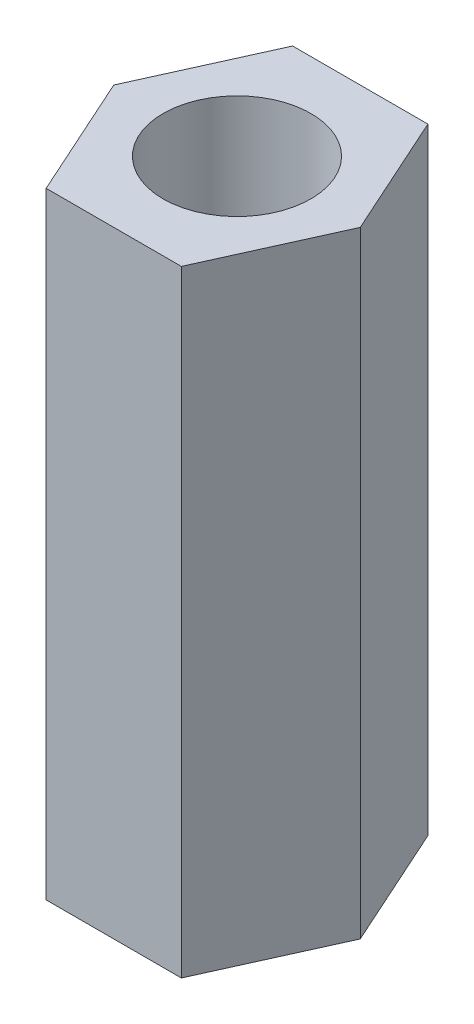
ISO-10303-21;
HEADER;
FILE_DESCRIPTION(('STEP AP214'),'2;1');
FILE_NAME('part.step','',(''),(''),'','','');
FILE_SCHEMA(('AUTOMOTIVE_DESIGN { 1 0 10303 214 1 1 1 1 }'));
ENDSEC;
DATA;
#1=APPLICATION_CONTEXT('core data for automotive mechanical design processes');
#2=APPLICATION_PROTOCOL_DEFINITION('international standard','automotive_design',2000,#1);
#3=PRODUCT_CONTEXT('',#1,'mechanical');
#4=PRODUCT('Part','Part','',(#3));
#5=PRODUCT_RELATED_PRODUCT_CATEGORY('part','',(#4));
#6=PRODUCT_DEFINITION_FORMATION('','',#4);
#7=PRODUCT_DEFINITION_CONTEXT('part definition',#1,'design');
#8=PRODUCT_DEFINITION('design','',#6,#7);
#9=PRODUCT_DEFINITION_SHAPE('','',#8);
#10=(LENGTH_UNIT() NAMED_UNIT(*) SI_UNIT(.MILLI.,.METRE.));
#11=(NAMED_UNIT(*) PLANE_ANGLE_UNIT() SI_UNIT($,.RADIAN.));
#12=(NAMED_UNIT(*) SI_UNIT($,.STERADIAN.) SOLID_ANGLE_UNIT());
#13=UNCERTAINTY_MEASURE_WITH_UNIT(LENGTH_MEASURE(1.E-05),#10,'distance_accuracy_value','');
#14=(GEOMETRIC_REPRESENTATION_CONTEXT(3) GLOBAL_UNCERTAINTY_ASSIGNED_CONTEXT((#13)) GLOBAL_UNIT_ASSIGNED_CONTEXT((#10,
#11,#12)) REPRESENTATION_CONTEXT('',''));
#15=CARTESIAN_POINT('',(0.,0.,0.));
#16=DIRECTION('',(0.,0.,1.));
#17=DIRECTION('',(1.,0.,0.));
#18=AXIS2_PLACEMENT_3D('',#15,#16,#17);
#19=CARTESIAN_POINT('',(-7.25708114822568,25.,-5.));
#20=DIRECTION('',(0.,-1.,0.));
#21=DIRECTION('',(0.,0.,-1.));
#22=AXIS2_PLACEMENT_3D('',#19,#20,#21);
#23=PLANE('',#22);
#24=DIRECTION('',(0.411437827766148,0.,0.911437827766148));
#25=VECTOR('',#24,1.);
#26=CARTESIAN_POINT('',(-2.74291885177432,25.,5.));
#27=LINE('',#26,#25);
#28=CARTESIAN_POINT('',(-5.,25.,0.));
#29=VERTEX_POINT('',#28);
#30=CARTESIAN_POINT('',(-2.74291885177432,25.,5.));
#31=VERTEX_POINT('',#30);
#32=EDGE_CURVE('E129',#29,#31,#27,.T.);
#33=ORIENTED_EDGE('',*,*,#32,.T.);
#34=DIRECTION('',(1.,0.,0.));
#35=VECTOR('',#34,1.);
#36=CARTESIAN_POINT('',(2.74291885177432,25.,5.));
#37=LINE('',#36,#35);
#38=CARTESIAN_POINT('',(2.74291885177432,25.,5.));
#39=VERTEX_POINT('',#38);
#40=EDGE_CURVE('E87',#31,#39,#37,.T.);
#41=ORIENTED_EDGE('',*,*,#40,.T.);
#42=DIRECTION('',(0.411437827766148,0.,-0.911437827766147));
#43=VECTOR('',#42,1.);
#44=CARTESIAN_POINT('',(5.,25.,0.));
#45=LINE('',#44,#43);
#46=CARTESIAN_POINT('',(5.,25.,0.));
#47=VERTEX_POINT('',#46);
#48=EDGE_CURVE('E100',#39,#47,#45,.T.);
#49=ORIENTED_EDGE('',*,*,#48,.T.);
#50=DIRECTION('',(-0.411437827766148,0.,-0.911437827766147));
#51=VECTOR('',#50,1.);
#52=CARTESIAN_POINT('',(2.74291885177432,25.,-5.));
#53=LINE('',#52,#51);
#54=CARTESIAN_POINT('',(2.74291885177432,25.,-5.));
#55=VERTEX_POINT('',#54);
#56=EDGE_CURVE('E94',#47,#55,#53,.T.);
#57=ORIENTED_EDGE('',*,*,#56,.T.);
#58=DIRECTION('',(-1.,0.,0.));
#59=VECTOR('',#58,1.);
#60=CARTESIAN_POINT('',(-2.74291885177432,25.,-5.));
#61=LINE('',#60,#59);
#62=CARTESIAN_POINT('',(-2.74291885177432,25.,-5.));
#63=VERTEX_POINT('',#62);
#64=EDGE_CURVE('E98',#55,#63,#61,.T.);
#65=ORIENTED_EDGE('',*,*,#64,.T.);
#66=DIRECTION('',(-0.411437827766148,0.,0.911437827766148));
#67=VECTOR('',#66,1.);
#68=CARTESIAN_POINT('',(-5.,25.,0.));
#69=LINE('',#68,#67);
#70=EDGE_CURVE('E50',#63,#29,#69,.T.);
#71=ORIENTED_EDGE('',*,*,#70,.T.);
#72=EDGE_LOOP('',(#33,#41,#49,#57,#65,#71));
#73=FACE_BOUND('',#72,.T.);
#74=CARTESIAN_POINT('',(0.,25.,0.));
#75=DIRECTION('',(0.,1.,0.));
#76=DIRECTION('',(0.,0.,1.));
#77=AXIS2_PLACEMENT_3D('',#74,#75,#76);
#78=CIRCLE('',#77,3.);
#79=CARTESIAN_POINT('',(0.,25.,3.));
#80=VERTEX_POINT('',#79);
#81=EDGE_CURVE('E122',#80,#80,#78,.T.);
#82=ORIENTED_EDGE('',*,*,#81,.F.);
#83=EDGE_LOOP('',(#82));
#84=FACE_BOUND('',#83,.T.);
#85=ADVANCED_FACE('F33',(#73,#84),#23,.F.);
#86=CARTESIAN_POINT('',(-7.25708114822568,0.,-5.));
#87=DIRECTION('',(0.,-1.,0.));
#88=DIRECTION('',(0.,0.,-1.));
#89=AXIS2_PLACEMENT_3D('',#86,#87,#88);
#90=PLANE('',#89);
#91=DIRECTION('',(0.411437827766148,0.,0.911437827766148));
#92=VECTOR('',#91,1.);
#93=CARTESIAN_POINT('',(-2.74291885177432,0.,5.));
#94=LINE('',#93,#92);
#95=CARTESIAN_POINT('',(-5.,0.,0.));
#96=VERTEX_POINT('',#95);
#97=CARTESIAN_POINT('',(-2.74291885177432,0.,5.));
#98=VERTEX_POINT('',#97);
#99=EDGE_CURVE('E118',#96,#98,#94,.T.);
#100=ORIENTED_EDGE('',*,*,#99,.F.);
#101=DIRECTION('',(-0.411437827766148,0.,0.911437827766148));
#102=VECTOR('',#101,1.);
#103=CARTESIAN_POINT('',(-5.,0.,0.));
#104=LINE('',#103,#102);
#105=CARTESIAN_POINT('',(-2.74291885177432,0.,-5.));
#106=VERTEX_POINT('',#105);
#107=EDGE_CURVE('E79',#106,#96,#104,.T.);
#108=ORIENTED_EDGE('',*,*,#107,.F.);
#109=DIRECTION('',(-1.,0.,0.));
#110=VECTOR('',#109,1.);
#111=CARTESIAN_POINT('',(-2.74291885177432,0.,-5.));
#112=LINE('',#111,#110);
#113=CARTESIAN_POINT('',(2.74291885177432,0.,-5.));
#114=VERTEX_POINT('',#113);
#115=EDGE_CURVE('E73',#114,#106,#112,.T.);
#116=ORIENTED_EDGE('',*,*,#115,.F.);
#117=DIRECTION('',(-0.411437827766148,0.,-0.911437827766147));
#118=VECTOR('',#117,1.);
#119=CARTESIAN_POINT('',(2.74291885177432,0.,-5.));
#120=LINE('',#119,#118);
#121=CARTESIAN_POINT('',(5.,0.,0.));
#122=VERTEX_POINT('',#121);
#123=EDGE_CURVE('E108',#122,#114,#120,.T.);
#124=ORIENTED_EDGE('',*,*,#123,.F.);
#125=DIRECTION('',(0.411437827766148,0.,-0.911437827766147));
#126=VECTOR('',#125,1.);
#127=CARTESIAN_POINT('',(5.,0.,0.));
#128=LINE('',#127,#126);
#129=CARTESIAN_POINT('',(2.74291885177432,0.,5.));
#130=VERTEX_POINT('',#129);
#131=EDGE_CURVE('E124',#130,#122,#128,.T.);
#132=ORIENTED_EDGE('',*,*,#131,.F.);
#133=DIRECTION('',(1.,0.,0.));
#134=VECTOR('',#133,1.);
#135=CARTESIAN_POINT('',(2.74291885177432,0.,5.));
#136=LINE('',#135,#134);
#137=EDGE_CURVE('E121',#98,#130,#136,.T.);
#138=ORIENTED_EDGE('',*,*,#137,.F.);
#139=EDGE_LOOP('',(#100,#108,#116,#124,#132,#138));
#140=FACE_BOUND('',#139,.T.);
#141=CARTESIAN_POINT('',(0.,0.,0.));
#142=DIRECTION('',(0.,1.,0.));
#143=DIRECTION('',(0.,0.,1.));
#144=AXIS2_PLACEMENT_3D('',#141,#142,#143);
#145=CIRCLE('',#144,3.);
#146=CARTESIAN_POINT('',(0.,0.,3.));
#147=VERTEX_POINT('',#146);
#148=EDGE_CURVE('E222',#147,#147,#145,.T.);
#149=ORIENTED_EDGE('',*,*,#148,.T.);
#150=EDGE_LOOP('',(#149));
#151=FACE_BOUND('',#150,.T.);
#152=ADVANCED_FACE('F138',(#140,#151),#90,.T.);
#153=CARTESIAN_POINT('',(-2.74291885177432,25.,5.));
#154=DIRECTION('',(0.911437827766148,0.,-0.411437827766148));
#155=DIRECTION('',(-0.411437827766148,0.,-0.911437827766148));
#156=AXIS2_PLACEMENT_3D('',#153,#154,#155);
#157=PLANE('',#156);
#158=ORIENTED_EDGE('',*,*,#99,.T.);
#159=DIRECTION('',(0.,-1.,0.));
#160=VECTOR('',#159,1.);
#161=CARTESIAN_POINT('',(-2.74291885177432,25.,5.));
#162=LINE('',#161,#160);
#163=EDGE_CURVE('E11',#31,#98,#162,.T.);
#164=ORIENTED_EDGE('',*,*,#163,.F.);
#165=ORIENTED_EDGE('',*,*,#32,.F.);
#166=DIRECTION('',(0.,-1.,0.));
#167=VECTOR('',#166,1.);
#168=CARTESIAN_POINT('',(-5.,25.,0.));
#169=LINE('',#168,#167);
#170=EDGE_CURVE('E114',#29,#96,#169,.T.);
#171=ORIENTED_EDGE('',*,*,#170,.T.);
#172=EDGE_LOOP('',(#158,#164,#165,#171));
#173=FACE_BOUND('',#172,.T.);
#174=ADVANCED_FACE('F35',(#173),#157,.F.);
#175=CARTESIAN_POINT('',(2.74291885177432,25.,5.));
#176=DIRECTION('',(0.,0.,-1.));
#177=DIRECTION('',(-1.,0.,0.));
#178=AXIS2_PLACEMENT_3D('',#175,#176,#177);
#179=PLANE('',#178);
#180=ORIENTED_EDGE('',*,*,#137,.T.);
#181=DIRECTION('',(0.,-1.,0.));
#182=VECTOR('',#181,1.);
#183=CARTESIAN_POINT('',(2.74291885177432,25.,5.));
#184=LINE('',#183,#182);
#185=EDGE_CURVE('E42',#39,#130,#184,.T.);
#186=ORIENTED_EDGE('',*,*,#185,.F.);
#187=ORIENTED_EDGE('',*,*,#40,.F.);
#188=ORIENTED_EDGE('',*,*,#163,.T.);
#189=EDGE_LOOP('',(#180,#186,#187,#188));
#190=FACE_BOUND('',#189,.T.);
#191=ADVANCED_FACE('F163',(#190),#179,.F.);
#192=CARTESIAN_POINT('',(5.,25.,0.));
#193=DIRECTION('',(-0.911437827766147,0.,-0.411437827766148));
#194=DIRECTION('',(-0.411437827766148,0.,0.911437827766147));
#195=AXIS2_PLACEMENT_3D('',#192,#193,#194);
#196=PLANE('',#195);
#197=ORIENTED_EDGE('',*,*,#131,.T.);
#198=DIRECTION('',(0.,-1.,0.));
#199=VECTOR('',#198,1.);
#200=CARTESIAN_POINT('',(5.,25.,0.));
#201=LINE('',#200,#199);
#202=EDGE_CURVE('E109',#47,#122,#201,.T.);
#203=ORIENTED_EDGE('',*,*,#202,.F.);
#204=ORIENTED_EDGE('',*,*,#48,.F.);
#205=ORIENTED_EDGE('',*,*,#185,.T.);
#206=EDGE_LOOP('',(#197,#203,#204,#205));
#207=FACE_BOUND('',#206,.T.);
#208=ADVANCED_FACE('F135',(#207),#196,.F.);
#209=CARTESIAN_POINT('',(2.74291885177432,25.,-5.));
#210=DIRECTION('',(-0.911437827766147,0.,0.411437827766148));
#211=DIRECTION('',(0.411437827766148,0.,0.911437827766148));
#212=AXIS2_PLACEMENT_3D('',#209,#210,#211);
#213=PLANE('',#212);
#214=ORIENTED_EDGE('',*,*,#123,.T.);
#215=DIRECTION('',(0.,-1.,0.));
#216=VECTOR('',#215,1.);
#217=CARTESIAN_POINT('',(2.74291885177432,25.,-5.));
#218=LINE('',#217,#216);
#219=EDGE_CURVE('E105',#55,#114,#218,.T.);
#220=ORIENTED_EDGE('',*,*,#219,.F.);
#221=ORIENTED_EDGE('',*,*,#56,.F.);
#222=ORIENTED_EDGE('',*,*,#202,.T.);
#223=EDGE_LOOP('',(#214,#220,#221,#222));
#224=FACE_BOUND('',#223,.T.);
#225=ADVANCED_FACE('F106',(#224),#213,.F.);
#226=CARTESIAN_POINT('',(-2.74291885177432,25.,-5.));
#227=DIRECTION('',(0.,0.,1.));
#228=DIRECTION('',(1.,0.,0.));
#229=AXIS2_PLACEMENT_3D('',#226,#227,#228);
#230=PLANE('',#229);
#231=ORIENTED_EDGE('',*,*,#115,.T.);
#232=DIRECTION('',(0.,-1.,0.));
#233=VECTOR('',#232,1.);
#234=CARTESIAN_POINT('',(-2.74291885177432,25.,-5.));
#235=LINE('',#234,#233);
#236=EDGE_CURVE('E110',#63,#106,#235,.T.);
#237=ORIENTED_EDGE('',*,*,#236,.F.);
#238=ORIENTED_EDGE('',*,*,#64,.F.);
#239=ORIENTED_EDGE('',*,*,#219,.T.);
#240=EDGE_LOOP('',(#231,#237,#238,#239));
#241=FACE_BOUND('',#240,.T.);
#242=ADVANCED_FACE('F112',(#241),#230,.F.);
#243=CARTESIAN_POINT('',(-5.,25.,0.));
#244=DIRECTION('',(0.911437827766148,0.,0.411437827766148));
#245=DIRECTION('',(0.411437827766148,0.,-0.911437827766148));
#246=AXIS2_PLACEMENT_3D('',#243,#244,#245);
#247=PLANE('',#246);
#248=ORIENTED_EDGE('',*,*,#107,.T.);
#249=ORIENTED_EDGE('',*,*,#170,.F.);
#250=ORIENTED_EDGE('',*,*,#70,.F.);
#251=ORIENTED_EDGE('',*,*,#236,.T.);
#252=EDGE_LOOP('',(#248,#249,#250,#251));
#253=FACE_BOUND('',#252,.T.);
#254=ADVANCED_FACE('F143',(#253),#247,.F.);
#255=CARTESIAN_POINT('',(0.,25.,0.));
#256=DIRECTION('',(0.,-1.,0.));
#257=DIRECTION('',(0.,0.,-1.));
#258=AXIS2_PLACEMENT_3D('',#255,#256,#257);
#259=CYLINDRICAL_SURFACE('',#258,3.);
#260=ORIENTED_EDGE('',*,*,#81,.T.);
#261=EDGE_LOOP('',(#260));
#262=FACE_BOUND('',#261,.T.);
#263=ORIENTED_EDGE('',*,*,#148,.F.);
#264=EDGE_LOOP('',(#263));
#265=FACE_BOUND('',#264,.T.);
#266=ADVANCED_FACE('F145',(#262,#265),#259,.F.);
#267=CLOSED_SHELL('',(#85,#152,#174,#191,#208,#225,#242,#254,#266));
#268=MANIFOLD_SOLID_BREP('B2',#267);
#269=ADVANCED_BREP_SHAPE_REPRESENTATION('',(#18,#268),#14);
#270=SHAPE_DEFINITION_REPRESENTATION(#9,#269);
ENDSEC;
END-ISO-10303-21;
